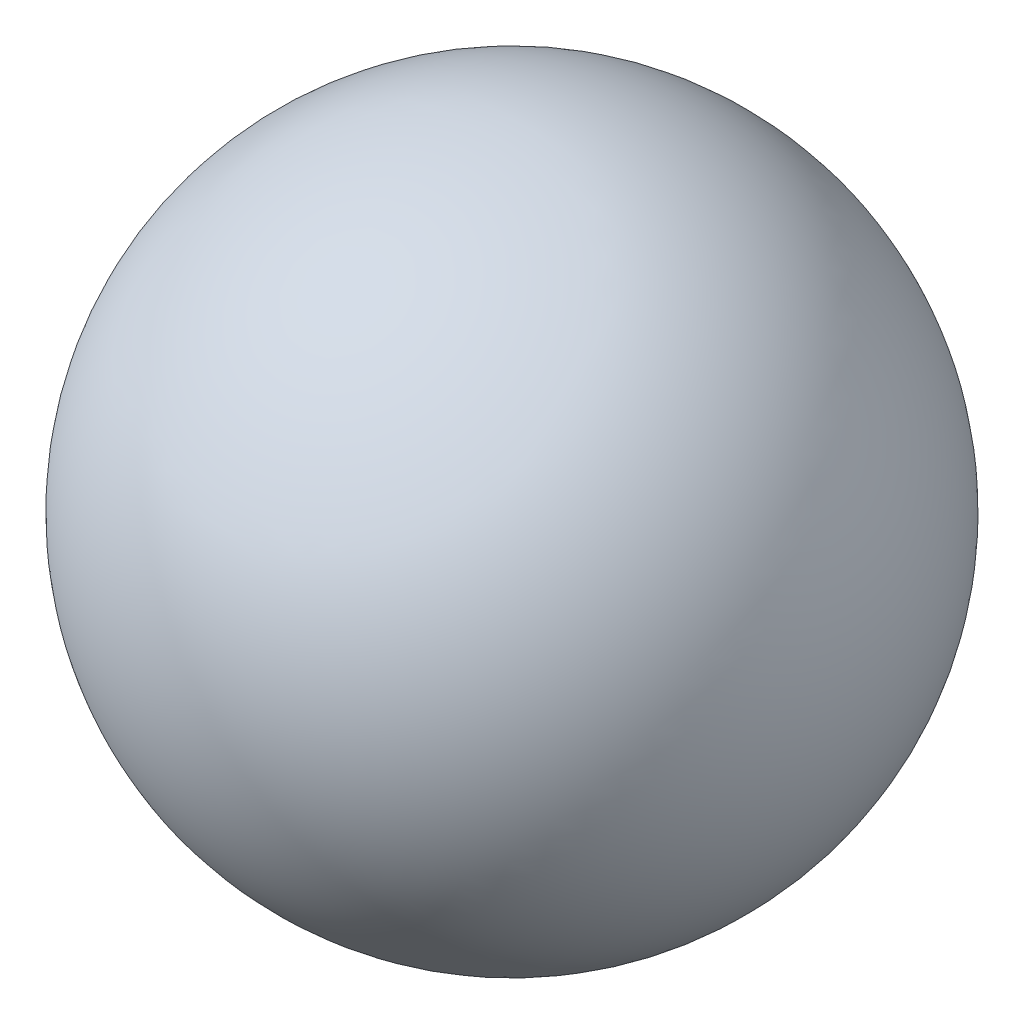
ISO-10303-21;
HEADER;
FILE_DESCRIPTION(('STEP AP214'),'2;1');
FILE_NAME('part.step','',(''),(''),'','','');
FILE_SCHEMA(('AUTOMOTIVE_DESIGN { 1 0 10303 214 1 1 1 1 }'));
ENDSEC;
DATA;
#1=APPLICATION_CONTEXT('core data for automotive mechanical design processes');
#2=APPLICATION_PROTOCOL_DEFINITION('international standard','automotive_design',2000,#1);
#3=PRODUCT_CONTEXT('',#1,'mechanical');
#4=PRODUCT('Part','Part','',(#3));
#5=PRODUCT_RELATED_PRODUCT_CATEGORY('part','',(#4));
#6=PRODUCT_DEFINITION_FORMATION('','',#4);
#7=PRODUCT_DEFINITION_CONTEXT('part definition',#1,'design');
#8=PRODUCT_DEFINITION('design','',#6,#7);
#9=PRODUCT_DEFINITION_SHAPE('','',#8);
#10=(LENGTH_UNIT() NAMED_UNIT(*) SI_UNIT(.MILLI.,.METRE.));
#11=(NAMED_UNIT(*) PLANE_ANGLE_UNIT() SI_UNIT($,.RADIAN.));
#12=(NAMED_UNIT(*) SI_UNIT($,.STERADIAN.) SOLID_ANGLE_UNIT());
#13=UNCERTAINTY_MEASURE_WITH_UNIT(LENGTH_MEASURE(1.E-05),#10,'distance_accuracy_value','');
#14=(GEOMETRIC_REPRESENTATION_CONTEXT(3) GLOBAL_UNCERTAINTY_ASSIGNED_CONTEXT((#13)) GLOBAL_UNIT_ASSIGNED_CONTEXT((#10,
#11,#12)) REPRESENTATION_CONTEXT('',''));
#15=CARTESIAN_POINT('',(0.,0.,0.));
#16=DIRECTION('',(0.,0.,1.));
#17=DIRECTION('',(1.,0.,0.));
#18=AXIS2_PLACEMENT_3D('',#15,#16,#17);
#19=CARTESIAN_POINT('',(0.,0.,0.));
#20=DIRECTION('',(0.,0.,-1.));
#21=DIRECTION('',(1.,0.,0.));
#22=AXIS2_PLACEMENT_3D('',#19,#20,#21);
#23=SPHERICAL_SURFACE('',#22,9.525);
#24=CARTESIAN_POINT('',(0.,0.,-9.525));
#25=VERTEX_POINT('',#24);
#26=VERTEX_LOOP('',#25);
#27=FACE_BOUND('',#26,.T.);
#28=ADVANCED_FACE('F28',(#27),#23,.T.);
#29=CLOSED_SHELL('',(#28));
#30=MANIFOLD_SOLID_BREP('B2',#29);
#31=ADVANCED_BREP_SHAPE_REPRESENTATION('',(#18,#30),#14);
#32=SHAPE_DEFINITION_REPRESENTATION(#9,#31);
ENDSEC;
END-ISO-10303-21;
